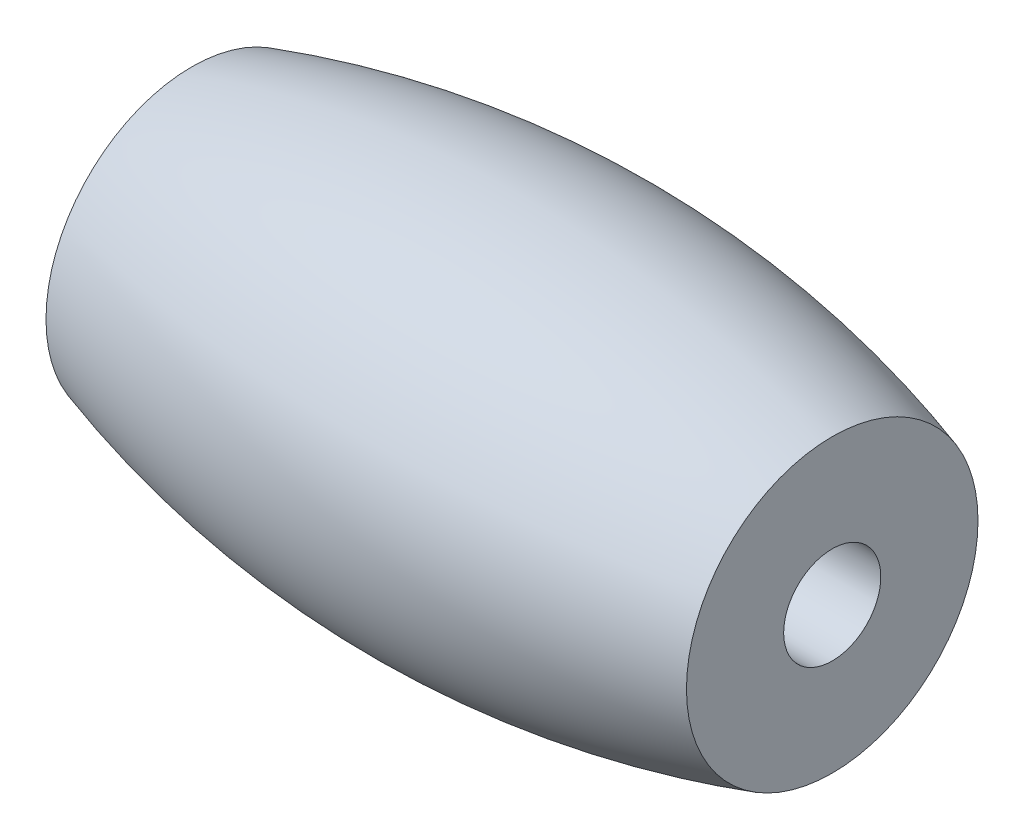
ISO-10303-21;
HEADER;
FILE_DESCRIPTION(('STEP AP214'),'2;1');
FILE_NAME('part.step','',(''),(''),'','','');
FILE_SCHEMA(('AUTOMOTIVE_DESIGN { 1 0 10303 214 1 1 1 1 }'));
ENDSEC;
DATA;
#1=APPLICATION_CONTEXT('core data for automotive mechanical design processes');
#2=APPLICATION_PROTOCOL_DEFINITION('international standard','automotive_design',2000,#1);
#3=PRODUCT_CONTEXT('',#1,'mechanical');
#4=PRODUCT('Part','Part','',(#3));
#5=PRODUCT_RELATED_PRODUCT_CATEGORY('part','',(#4));
#6=PRODUCT_DEFINITION_FORMATION('','',#4);
#7=PRODUCT_DEFINITION_CONTEXT('part definition',#1,'design');
#8=PRODUCT_DEFINITION('design','',#6,#7);
#9=PRODUCT_DEFINITION_SHAPE('','',#8);
#10=(LENGTH_UNIT() NAMED_UNIT(*) SI_UNIT(.MILLI.,.METRE.));
#11=(NAMED_UNIT(*) PLANE_ANGLE_UNIT() SI_UNIT($,.RADIAN.));
#12=(NAMED_UNIT(*) SI_UNIT($,.STERADIAN.) SOLID_ANGLE_UNIT());
#13=UNCERTAINTY_MEASURE_WITH_UNIT(LENGTH_MEASURE(1.E-05),#10,'distance_accuracy_value','');
#14=(GEOMETRIC_REPRESENTATION_CONTEXT(3) GLOBAL_UNCERTAINTY_ASSIGNED_CONTEXT((#13)) GLOBAL_UNIT_ASSIGNED_CONTEXT((#10,
#11,#12)) REPRESENTATION_CONTEXT('',''));
#15=CARTESIAN_POINT('',(0.,0.,0.));
#16=DIRECTION('',(0.,0.,1.));
#17=DIRECTION('',(1.,0.,0.));
#18=AXIS2_PLACEMENT_3D('',#15,#16,#17);
#19=CARTESIAN_POINT('',(19.205298013245,0.,0.));
#20=DIRECTION('',(1.,0.,0.));
#21=DIRECTION('',(0.,0.,-1.));
#22=AXIS2_PLACEMENT_3D('',#19,#20,#21);
#23=PLANE('',#22);
#24=CARTESIAN_POINT('',(19.205298013245,0.,0.));
#25=DIRECTION('',(-1.,0.,0.));
#26=DIRECTION('',(0.,0.,1.));
#27=AXIS2_PLACEMENT_3D('',#24,#25,#26);
#28=CIRCLE('',#27,2.91390728476821);
#29=CARTESIAN_POINT('',(19.205298013245,0.,2.91390728476821));
#30=VERTEX_POINT('',#29);
#31=EDGE_CURVE('E42',#30,#30,#28,.T.);
#32=ORIENTED_EDGE('',*,*,#31,.T.);
#33=EDGE_LOOP('',(#32));
#34=FACE_BOUND('',#33,.T.);
#35=CARTESIAN_POINT('',(19.205298013245,0.,0.));
#36=DIRECTION('',(-1.,0.,0.));
#37=DIRECTION('',(0.,0.,1.));
#38=AXIS2_PLACEMENT_3D('',#35,#36,#37);
#39=CIRCLE('',#38,8.74172185430463);
#40=CARTESIAN_POINT('',(19.205298013245,0.,8.74172185430463));
#41=VERTEX_POINT('',#40);
#42=EDGE_CURVE('E10',#41,#41,#39,.T.);
#43=ORIENTED_EDGE('',*,*,#42,.F.);
#44=EDGE_LOOP('',(#43));
#45=FACE_BOUND('',#44,.T.);
#46=ADVANCED_FACE('F32',(#34,#45),#23,.T.);
#47=CARTESIAN_POINT('',(0.,0.,0.));
#48=DIRECTION('',(-1.,0.,0.));
#49=DIRECTION('',(0.,0.,1.));
#50=AXIS2_PLACEMENT_3D('',#47,#48,#49);
#51=DEGENERATE_TOROIDAL_SURFACE('',#50,53.0915111252604,64.7471402649007,.F.);
#52=ORIENTED_EDGE('',*,*,#42,.T.);
#53=EDGE_LOOP('',(#52));
#54=FACE_BOUND('',#53,.T.);
#55=CARTESIAN_POINT('',(-19.205298013245,0.,0.));
#56=DIRECTION('',(-1.,0.,0.));
#57=DIRECTION('',(0.,0.,1.));
#58=AXIS2_PLACEMENT_3D('',#55,#56,#57);
#59=CIRCLE('',#58,8.74172185430464);
#60=CARTESIAN_POINT('',(-19.205298013245,0.,8.74172185430464));
#61=VERTEX_POINT('',#60);
#62=EDGE_CURVE('E38',#61,#61,#59,.T.);
#63=ORIENTED_EDGE('',*,*,#62,.F.);
#64=EDGE_LOOP('',(#63));
#65=FACE_BOUND('',#64,.T.);
#66=ADVANCED_FACE('F56',(#54,#65),#51,.F.);
#67=CARTESIAN_POINT('',(-19.205298013245,0.,0.));
#68=DIRECTION('',(-1.,0.,0.));
#69=DIRECTION('',(0.,0.,1.));
#70=AXIS2_PLACEMENT_3D('',#67,#68,#69);
#71=PLANE('',#70);
#72=CARTESIAN_POINT('',(-19.205298013245,0.,0.));
#73=DIRECTION('',(-1.,0.,0.));
#74=DIRECTION('',(0.,0.,1.));
#75=AXIS2_PLACEMENT_3D('',#72,#73,#74);
#76=CIRCLE('',#75,2.91390728476821);
#77=CARTESIAN_POINT('',(-19.205298013245,0.,2.91390728476822));
#78=VERTEX_POINT('',#77);
#79=EDGE_CURVE('E46',#78,#78,#76,.T.);
#80=ORIENTED_EDGE('',*,*,#79,.F.);
#81=EDGE_LOOP('',(#80));
#82=FACE_BOUND('',#81,.T.);
#83=ORIENTED_EDGE('',*,*,#62,.T.);
#84=EDGE_LOOP('',(#83));
#85=FACE_BOUND('',#84,.T.);
#86=ADVANCED_FACE('F54',(#82,#85),#71,.T.);
#87=CARTESIAN_POINT('',(19.205298013245,0.,0.));
#88=DIRECTION('',(-1.,0.,0.));
#89=DIRECTION('',(0.,0.,1.));
#90=AXIS2_PLACEMENT_3D('',#87,#88,#89);
#91=CYLINDRICAL_SURFACE('',#90,2.91390728476821);
#92=ORIENTED_EDGE('',*,*,#31,.F.);
#93=EDGE_LOOP('',(#92));
#94=FACE_BOUND('',#93,.T.);
#95=ORIENTED_EDGE('',*,*,#79,.T.);
#96=EDGE_LOOP('',(#95));
#97=FACE_BOUND('',#96,.T.);
#98=ADVANCED_FACE('F52',(#94,#97),#91,.F.);
#99=CLOSED_SHELL('',(#46,#66,#86,#98));
#100=MANIFOLD_SOLID_BREP('B2',#99);
#101=ADVANCED_BREP_SHAPE_REPRESENTATION('',(#18,#100),#14);
#102=SHAPE_DEFINITION_REPRESENTATION(#9,#101);
ENDSEC;
END-ISO-10303-21;
